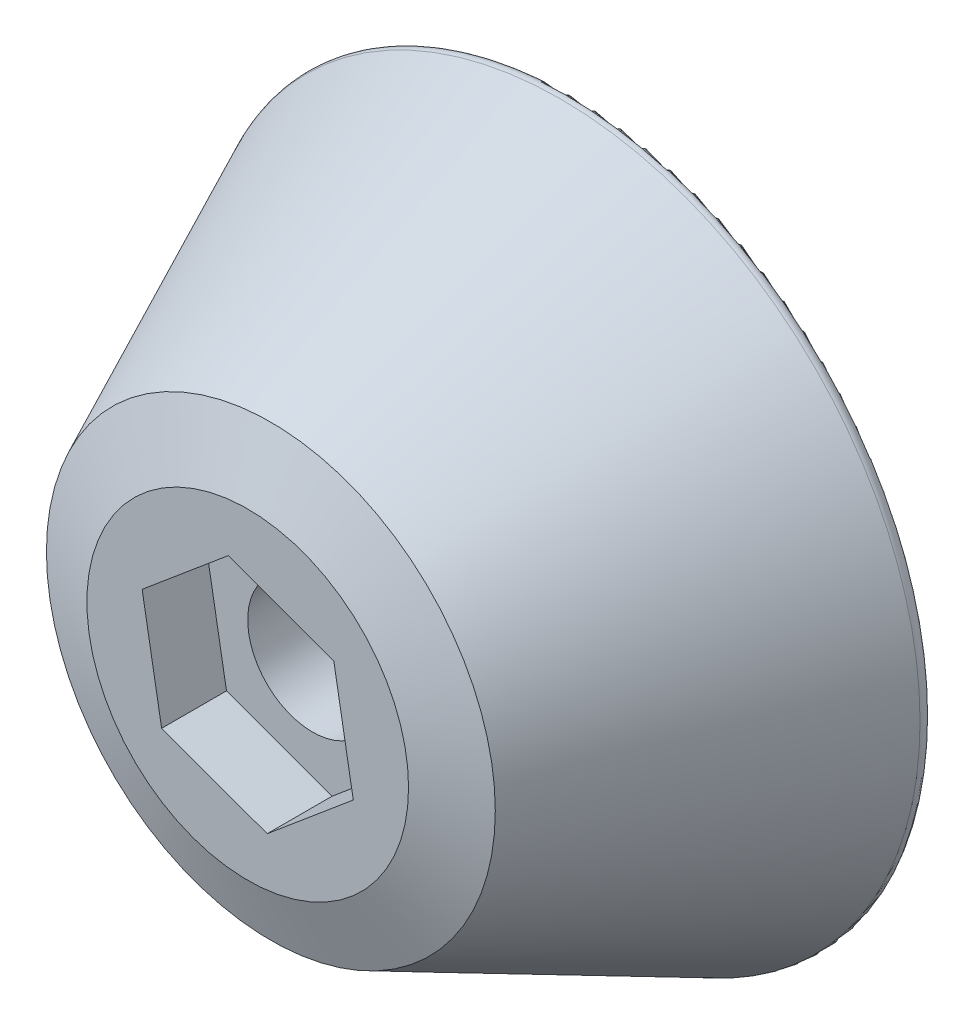
ISO-10303-21;
HEADER;
FILE_DESCRIPTION(('STEP AP214'),'2;1');
FILE_NAME('part.step','',(''),(''),'','','');
FILE_SCHEMA(('AUTOMOTIVE_DESIGN { 1 0 10303 214 1 1 1 1 }'));
ENDSEC;
DATA;
#1=APPLICATION_CONTEXT('core data for automotive mechanical design processes');
#2=APPLICATION_PROTOCOL_DEFINITION('international standard','automotive_design',2000,#1);
#3=PRODUCT_CONTEXT('',#1,'mechanical');
#4=PRODUCT('Part','Part','',(#3));
#5=PRODUCT_RELATED_PRODUCT_CATEGORY('part','',(#4));
#6=PRODUCT_DEFINITION_FORMATION('','',#4);
#7=PRODUCT_DEFINITION_CONTEXT('part definition',#1,'design');
#8=PRODUCT_DEFINITION('design','',#6,#7);
#9=PRODUCT_DEFINITION_SHAPE('','',#8);
#10=(LENGTH_UNIT() NAMED_UNIT(*) SI_UNIT(.MILLI.,.METRE.));
#11=(NAMED_UNIT(*) PLANE_ANGLE_UNIT() SI_UNIT($,.RADIAN.));
#12=(NAMED_UNIT(*) SI_UNIT($,.STERADIAN.) SOLID_ANGLE_UNIT());
#13=UNCERTAINTY_MEASURE_WITH_UNIT(LENGTH_MEASURE(1.E-05),#10,'distance_accuracy_value','');
#14=(GEOMETRIC_REPRESENTATION_CONTEXT(3) GLOBAL_UNCERTAINTY_ASSIGNED_CONTEXT((#13)) GLOBAL_UNIT_ASSIGNED_CONTEXT((#10,
#11,#12)) REPRESENTATION_CONTEXT('',''));
#15=CARTESIAN_POINT('',(0.,0.,0.));
#16=DIRECTION('',(0.,0.,1.));
#17=DIRECTION('',(1.,0.,0.));
#18=AXIS2_PLACEMENT_3D('',#15,#16,#17);
#19=CARTESIAN_POINT('',(0.,0.,0.));
#20=DIRECTION('',(0.,0.,-1.));
#21=DIRECTION('',(1.,0.,0.));
#22=AXIS2_PLACEMENT_3D('',#19,#20,#21);
#23=CONICAL_SURFACE('',#22,28.575,0.436332312998583);
#24=CARTESIAN_POINT('',(0.,0.,0.903362596205347));
#25=DIRECTION('',(0.,0.,1.));
#26=DIRECTION('',(1.,0.,0.));
#27=AXIS2_PLACEMENT_3D('',#24,#25,#26);
#28=CIRCLE('',#27,28.1537551032987);
#29=CARTESIAN_POINT('',(28.1537551032987,0.,0.903362596205347));
#30=VERTEX_POINT('',#29);
#31=EDGE_CURVE('E43',#30,#30,#28,.T.);
#32=ORIENTED_EDGE('',*,*,#31,.T.);
#33=EDGE_LOOP('',(#32));
#34=FACE_BOUND('',#33,.T.);
#35=CARTESIAN_POINT('',(0.,0.,23.5873844259267));
#36=DIRECTION('',(0.,0.,-1.));
#37=DIRECTION('',(-1.,0.,0.));
#38=AXIS2_PLACEMENT_3D('',#35,#36,#37);
#39=CIRCLE('',#38,17.5760220063444);
#40=CARTESIAN_POINT('',(-17.5760220063444,0.,23.5873844259267));
#41=VERTEX_POINT('',#40);
#42=EDGE_CURVE('E146',#41,#41,#39,.T.);
#43=ORIENTED_EDGE('',*,*,#42,.T.);
#44=EDGE_LOOP('',(#43));
#45=FACE_BOUND('',#44,.T.);
#46=ADVANCED_FACE('F35',(#34,#45),#23,.T.);
#47=CARTESIAN_POINT('',(0.,0.,25.4));
#48=DIRECTION('',(0.,0.,1.));
#49=DIRECTION('',(1.,0.,0.));
#50=AXIS2_PLACEMENT_3D('',#47,#48,#49);
#51=PLANE('',#50);
#52=DIRECTION('',(-0.173424497134288,0.984847167734019,0.));
#53=VECTOR('',#52,1.);
#54=CARTESIAN_POINT('',(8.26750072052995,-3.01125087563902,25.4));
#55=LINE('',#54,#53);
#56=CARTESIAN_POINT('',(8.26750072052995,-3.01125087563902,25.4));
#57=VERTEX_POINT('',#56);
#58=CARTESIAN_POINT('',(6.74157011573651,5.65424021196558,25.4));
#59=VERTEX_POINT('',#58);
#60=EDGE_CURVE('E50',#57,#59,#55,.T.);
#61=ORIENTED_EDGE('',*,*,#60,.F.);
#62=DIRECTION('',(0.766190417535671,0.642613604023844,0.));
#63=VECTOR('',#62,1.);
#64=CARTESIAN_POINT('',(1.52593060479344,-8.6654910876046,25.4));
#65=LINE('',#64,#63);
#66=CARTESIAN_POINT('',(1.52593060479344,-8.6654910876046,25.4));
#67=VERTEX_POINT('',#66);
#68=EDGE_CURVE('E134',#67,#57,#65,.T.);
#69=ORIENTED_EDGE('',*,*,#68,.F.);
#70=DIRECTION('',(0.939614914669959,-0.342233563710175,0.));
#71=VECTOR('',#70,1.);
#72=CARTESIAN_POINT('',(-6.7415701157365,-5.65424021196557,25.4));
#73=LINE('',#72,#71);
#74=CARTESIAN_POINT('',(-6.7415701157365,-5.65424021196557,25.4));
#75=VERTEX_POINT('',#74);
#76=EDGE_CURVE('E132',#75,#67,#73,.T.);
#77=ORIENTED_EDGE('',*,*,#76,.F.);
#78=DIRECTION('',(0.173424497134288,-0.984847167734019,0.));
#79=VECTOR('',#78,1.);
#80=CARTESIAN_POINT('',(-8.26750072052995,3.01125087563903,25.4));
#81=LINE('',#80,#79);
#82=CARTESIAN_POINT('',(-8.26750072052995,3.01125087563903,25.4));
#83=VERTEX_POINT('',#82);
#84=EDGE_CURVE('E98',#83,#75,#81,.T.);
#85=ORIENTED_EDGE('',*,*,#84,.F.);
#86=DIRECTION('',(-0.766190417535671,-0.642613604023844,0.));
#87=VECTOR('',#86,1.);
#88=CARTESIAN_POINT('',(-1.52593060479344,8.6654910876046,25.4));
#89=LINE('',#88,#87);
#90=CARTESIAN_POINT('',(-1.52593060479344,8.6654910876046,25.4));
#91=VERTEX_POINT('',#90);
#92=EDGE_CURVE('E128',#91,#83,#89,.T.);
#93=ORIENTED_EDGE('',*,*,#92,.F.);
#94=DIRECTION('',(-0.939614914669959,0.342233563710174,0.));
#95=VECTOR('',#94,1.);
#96=CARTESIAN_POINT('',(6.74157011573651,5.65424021196557,25.4));
#97=LINE('',#96,#95);
#98=EDGE_CURVE('E124',#59,#91,#97,.T.);
#99=ORIENTED_EDGE('',*,*,#98,.F.);
#100=EDGE_LOOP('',(#61,#69,#77,#85,#93,#99));
#101=FACE_BOUND('',#100,.T.);
#102=CARTESIAN_POINT('',(0.,0.,25.4));
#103=DIRECTION('',(0.,0.,1.));
#104=DIRECTION('',(1.,0.,0.));
#105=AXIS2_PLACEMENT_3D('',#102,#103,#104);
#106=CIRCLE('',#105,12.5959016464262);
#107=CARTESIAN_POINT('',(12.5959016464262,0.,25.4));
#108=VERTEX_POINT('',#107);
#109=EDGE_CURVE('E138',#108,#108,#106,.T.);
#110=ORIENTED_EDGE('',*,*,#109,.T.);
#111=EDGE_LOOP('',(#110));
#112=FACE_BOUND('',#111,.T.);
#113=ADVANCED_FACE('F163',(#101,#112),#51,.T.);
#114=CARTESIAN_POINT('',(0.,0.,0.));
#115=DIRECTION('',(0.,0.,1.));
#116=DIRECTION('',(1.,0.,0.));
#117=AXIS2_PLACEMENT_3D('',#114,#115,#116);
#118=PLANE('',#117);
#119=CARTESIAN_POINT('',(0.,0.,0.));
#120=DIRECTION('',(0.,0.,1.));
#121=DIRECTION('',(1.,0.,0.));
#122=AXIS2_PLACEMENT_3D('',#119,#120,#121);
#123=CIRCLE('',#122,27.5782496585304);
#124=CARTESIAN_POINT('',(27.5782496585304,0.,0.));
#125=VERTEX_POINT('',#124);
#126=EDGE_CURVE('E11',#125,#125,#123,.F.);
#127=ORIENTED_EDGE('',*,*,#126,.T.);
#128=EDGE_LOOP('',(#127));
#129=FACE_BOUND('',#128,.T.);
#130=CARTESIAN_POINT('',(0.,0.,0.));
#131=DIRECTION('',(0.,0.,1.));
#132=DIRECTION('',(1.,0.,0.));
#133=AXIS2_PLACEMENT_3D('',#130,#131,#132);
#134=CIRCLE('',#133,5.08);
#135=CARTESIAN_POINT('',(5.08,0.,0.));
#136=VERTEX_POINT('',#135);
#137=EDGE_CURVE('E125',#136,#136,#134,.T.);
#138=ORIENTED_EDGE('',*,*,#137,.T.);
#139=EDGE_LOOP('',(#138));
#140=FACE_BOUND('',#139,.T.);
#141=ADVANCED_FACE('F168',(#129,#140),#118,.F.);
#142=CARTESIAN_POINT('',(0.,0.,25.4));
#143=DIRECTION('',(0.,0.,-1.));
#144=DIRECTION('',(-1.,0.,0.));
#145=AXIS2_PLACEMENT_3D('',#142,#143,#144);
#146=CONICAL_SURFACE('',#145,12.5959016464262,1.22173047639603);
#147=ORIENTED_EDGE('',*,*,#42,.F.);
#148=EDGE_LOOP('',(#147));
#149=FACE_BOUND('',#148,.T.);
#150=ORIENTED_EDGE('',*,*,#109,.F.);
#151=EDGE_LOOP('',(#150));
#152=FACE_BOUND('',#151,.T.);
#153=ADVANCED_FACE('F173',(#149,#152),#146,.T.);
#154=CARTESIAN_POINT('',(8.26750072052995,-3.01125087563902,20.32));
#155=DIRECTION('',(0.984847167734019,0.173424497134288,0.));
#156=DIRECTION('',(-0.173424497134288,0.984847167734019,0.));
#157=AXIS2_PLACEMENT_3D('',#154,#155,#156);
#158=PLANE('',#157);
#159=ORIENTED_EDGE('',*,*,#60,.T.);
#160=DIRECTION('',(0.,0.,1.));
#161=VECTOR('',#160,1.);
#162=CARTESIAN_POINT('',(6.74157011573651,5.65424021196557,20.32));
#163=LINE('',#162,#161);
#164=CARTESIAN_POINT('',(6.74157011573651,5.65424021196557,20.32));
#165=VERTEX_POINT('',#164);
#166=EDGE_CURVE('E80',#165,#59,#163,.T.);
#167=ORIENTED_EDGE('',*,*,#166,.F.);
#168=DIRECTION('',(-0.173424497134288,0.984847167734019,0.));
#169=VECTOR('',#168,1.);
#170=CARTESIAN_POINT('',(8.26750072052995,-3.01125087563902,20.32));
#171=LINE('',#170,#169);
#172=CARTESIAN_POINT('',(8.26750072052995,-3.01125087563902,20.32));
#173=VERTEX_POINT('',#172);
#174=EDGE_CURVE('E136',#173,#165,#171,.T.);
#175=ORIENTED_EDGE('',*,*,#174,.F.);
#176=DIRECTION('',(0.,0.,1.));
#177=VECTOR('',#176,1.);
#178=CARTESIAN_POINT('',(8.26750072052995,-3.01125087563902,20.32));
#179=LINE('',#178,#177);
#180=EDGE_CURVE('E58',#173,#57,#179,.T.);
#181=ORIENTED_EDGE('',*,*,#180,.T.);
#182=EDGE_LOOP('',(#159,#167,#175,#181));
#183=FACE_BOUND('',#182,.T.);
#184=ADVANCED_FACE('F177',(#183),#158,.F.);
#185=CARTESIAN_POINT('',(1.52593060479344,-8.6654910876046,20.32));
#186=DIRECTION('',(0.642613604023844,-0.766190417535671,0.));
#187=DIRECTION('',(0.766190417535671,0.642613604023844,0.));
#188=AXIS2_PLACEMENT_3D('',#185,#186,#187);
#189=PLANE('',#188);
#190=ORIENTED_EDGE('',*,*,#68,.T.);
#191=ORIENTED_EDGE('',*,*,#180,.F.);
#192=DIRECTION('',(0.766190417535671,0.642613604023844,0.));
#193=VECTOR('',#192,1.);
#194=CARTESIAN_POINT('',(1.52593060479344,-8.6654910876046,20.32));
#195=LINE('',#194,#193);
#196=CARTESIAN_POINT('',(1.52593060479344,-8.6654910876046,20.32));
#197=VERTEX_POINT('',#196);
#198=EDGE_CURVE('E110',#197,#173,#195,.T.);
#199=ORIENTED_EDGE('',*,*,#198,.F.);
#200=DIRECTION('',(0.,0.,1.));
#201=VECTOR('',#200,1.);
#202=CARTESIAN_POINT('',(1.52593060479344,-8.6654910876046,20.32));
#203=LINE('',#202,#201);
#204=EDGE_CURVE('E102',#197,#67,#203,.T.);
#205=ORIENTED_EDGE('',*,*,#204,.T.);
#206=EDGE_LOOP('',(#190,#191,#199,#205));
#207=FACE_BOUND('',#206,.T.);
#208=ADVANCED_FACE('F183',(#207),#189,.F.);
#209=CARTESIAN_POINT('',(-6.7415701157365,-5.65424021196557,20.32));
#210=DIRECTION('',(-0.342233563710175,-0.939614914669959,0.));
#211=DIRECTION('',(0.939614914669959,-0.342233563710175,0.));
#212=AXIS2_PLACEMENT_3D('',#209,#210,#211);
#213=PLANE('',#212);
#214=ORIENTED_EDGE('',*,*,#76,.T.);
#215=ORIENTED_EDGE('',*,*,#204,.F.);
#216=DIRECTION('',(0.939614914669959,-0.342233563710175,0.));
#217=VECTOR('',#216,1.);
#218=CARTESIAN_POINT('',(-6.7415701157365,-5.65424021196557,20.32));
#219=LINE('',#218,#217);
#220=CARTESIAN_POINT('',(-6.7415701157365,-5.65424021196557,20.32));
#221=VERTEX_POINT('',#220);
#222=EDGE_CURVE('E106',#221,#197,#219,.T.);
#223=ORIENTED_EDGE('',*,*,#222,.F.);
#224=DIRECTION('',(0.,0.,1.));
#225=VECTOR('',#224,1.);
#226=CARTESIAN_POINT('',(-6.7415701157365,-5.65424021196557,20.32));
#227=LINE('',#226,#225);
#228=EDGE_CURVE('E91',#221,#75,#227,.T.);
#229=ORIENTED_EDGE('',*,*,#228,.T.);
#230=EDGE_LOOP('',(#214,#215,#223,#229));
#231=FACE_BOUND('',#230,.T.);
#232=ADVANCED_FACE('F107',(#231),#213,.F.);
#233=CARTESIAN_POINT('',(-8.26750072052995,3.01125087563903,20.32));
#234=DIRECTION('',(-0.984847167734019,-0.173424497134288,0.));
#235=DIRECTION('',(0.173424497134288,-0.984847167734019,0.));
#236=AXIS2_PLACEMENT_3D('',#233,#234,#235);
#237=PLANE('',#236);
#238=ORIENTED_EDGE('',*,*,#84,.T.);
#239=ORIENTED_EDGE('',*,*,#228,.F.);
#240=DIRECTION('',(0.173424497134288,-0.984847167734019,0.));
#241=VECTOR('',#240,1.);
#242=CARTESIAN_POINT('',(-8.26750072052995,3.01125087563903,20.32));
#243=LINE('',#242,#241);
#244=CARTESIAN_POINT('',(-8.26750072052995,3.01125087563903,20.32));
#245=VERTEX_POINT('',#244);
#246=EDGE_CURVE('E95',#245,#221,#243,.T.);
#247=ORIENTED_EDGE('',*,*,#246,.F.);
#248=DIRECTION('',(0.,0.,1.));
#249=VECTOR('',#248,1.);
#250=CARTESIAN_POINT('',(-8.26750072052995,3.01125087563903,20.32));
#251=LINE('',#250,#249);
#252=EDGE_CURVE('E103',#245,#83,#251,.T.);
#253=ORIENTED_EDGE('',*,*,#252,.T.);
#254=EDGE_LOOP('',(#238,#239,#247,#253));
#255=FACE_BOUND('',#254,.T.);
#256=ADVANCED_FACE('F93',(#255),#237,.F.);
#257=CARTESIAN_POINT('',(-1.52593060479344,8.6654910876046,20.32));
#258=DIRECTION('',(-0.642613604023845,0.766190417535671,0.));
#259=DIRECTION('',(-0.766190417535671,-0.642613604023844,0.));
#260=AXIS2_PLACEMENT_3D('',#257,#258,#259);
#261=PLANE('',#260);
#262=ORIENTED_EDGE('',*,*,#92,.T.);
#263=ORIENTED_EDGE('',*,*,#252,.F.);
#264=DIRECTION('',(-0.766190417535671,-0.642613604023844,0.));
#265=VECTOR('',#264,1.);
#266=CARTESIAN_POINT('',(-1.52593060479344,8.6654910876046,20.32));
#267=LINE('',#266,#265);
#268=CARTESIAN_POINT('',(-1.52593060479344,8.6654910876046,20.32));
#269=VERTEX_POINT('',#268);
#270=EDGE_CURVE('E116',#269,#245,#267,.T.);
#271=ORIENTED_EDGE('',*,*,#270,.F.);
#272=DIRECTION('',(0.,0.,1.));
#273=VECTOR('',#272,1.);
#274=CARTESIAN_POINT('',(-1.52593060479344,8.6654910876046,20.32));
#275=LINE('',#274,#273);
#276=EDGE_CURVE('E141',#269,#91,#275,.T.);
#277=ORIENTED_EDGE('',*,*,#276,.T.);
#278=EDGE_LOOP('',(#262,#263,#271,#277));
#279=FACE_BOUND('',#278,.T.);
#280=ADVANCED_FACE('F205',(#279),#261,.F.);
#281=CARTESIAN_POINT('',(6.74157011573651,5.65424021196557,20.32));
#282=DIRECTION('',(0.342233563710174,0.939614914669959,0.));
#283=DIRECTION('',(-0.939614914669959,0.342233563710174,0.));
#284=AXIS2_PLACEMENT_3D('',#281,#282,#283);
#285=PLANE('',#284);
#286=ORIENTED_EDGE('',*,*,#98,.T.);
#287=ORIENTED_EDGE('',*,*,#276,.F.);
#288=DIRECTION('',(-0.939614914669959,0.342233563710174,0.));
#289=VECTOR('',#288,1.);
#290=CARTESIAN_POINT('',(6.74157011573651,5.65424021196557,20.32));
#291=LINE('',#290,#289);
#292=EDGE_CURVE('E118',#165,#269,#291,.T.);
#293=ORIENTED_EDGE('',*,*,#292,.F.);
#294=ORIENTED_EDGE('',*,*,#166,.T.);
#295=EDGE_LOOP('',(#286,#287,#293,#294));
#296=FACE_BOUND('',#295,.T.);
#297=ADVANCED_FACE('F201',(#296),#285,.F.);
#298=CARTESIAN_POINT('',(0.,0.,20.32));
#299=DIRECTION('',(0.,0.,1.));
#300=DIRECTION('',(1.,0.,0.));
#301=AXIS2_PLACEMENT_3D('',#298,#299,#300);
#302=PLANE('',#301);
#303=CARTESIAN_POINT('',(0.,0.,20.32));
#304=DIRECTION('',(0.,0.,1.));
#305=DIRECTION('',(1.,0.,0.));
#306=AXIS2_PLACEMENT_3D('',#303,#304,#305);
#307=CIRCLE('',#306,5.08);
#308=CARTESIAN_POINT('',(5.08,0.,20.32));
#309=VERTEX_POINT('',#308);
#310=EDGE_CURVE('E195',#309,#309,#307,.T.);
#311=ORIENTED_EDGE('',*,*,#310,.F.);
#312=EDGE_LOOP('',(#311));
#313=FACE_BOUND('',#312,.T.);
#314=ORIENTED_EDGE('',*,*,#174,.T.);
#315=ORIENTED_EDGE('',*,*,#292,.T.);
#316=ORIENTED_EDGE('',*,*,#270,.T.);
#317=ORIENTED_EDGE('',*,*,#246,.T.);
#318=ORIENTED_EDGE('',*,*,#222,.T.);
#319=ORIENTED_EDGE('',*,*,#198,.T.);
#320=EDGE_LOOP('',(#314,#315,#316,#317,#318,#319));
#321=FACE_BOUND('',#320,.T.);
#322=ADVANCED_FACE('F113',(#313,#321),#302,.T.);
#323=CARTESIAN_POINT('',(0.,0.,0.));
#324=DIRECTION('',(0.,0.,1.));
#325=DIRECTION('',(1.,0.,0.));
#326=AXIS2_PLACEMENT_3D('',#323,#324,#325);
#327=CYLINDRICAL_SURFACE('',#326,5.08);
#328=ORIENTED_EDGE('',*,*,#137,.F.);
#329=EDGE_LOOP('',(#328));
#330=FACE_BOUND('',#329,.T.);
#331=ORIENTED_EDGE('',*,*,#310,.T.);
#332=EDGE_LOOP('',(#331));
#333=FACE_BOUND('',#332,.T.);
#334=ADVANCED_FACE('F154',(#330,#333),#327,.F.);
#335=CARTESIAN_POINT('',(0.,0.,0.635));
#336=DIRECTION('',(0.,0.,1.));
#337=DIRECTION('',(1.,0.,0.));
#338=AXIS2_PLACEMENT_3D('',#335,#336,#337);
#339=TOROIDAL_SURFACE('',#338,27.5782496585304,0.635);
#340=ORIENTED_EDGE('',*,*,#126,.F.);
#341=EDGE_LOOP('',(#340));
#342=FACE_BOUND('',#341,.T.);
#343=ORIENTED_EDGE('',*,*,#31,.F.);
#344=EDGE_LOOP('',(#343));
#345=FACE_BOUND('',#344,.T.);
#346=ADVANCED_FACE('F37',(#342,#345),#339,.T.);
#347=CLOSED_SHELL('',(#46,#113,#141,#153,#184,#208,#232,#256,#280,#297,#322,#334,#346));
#348=MANIFOLD_SOLID_BREP('B2',#347);
#349=ADVANCED_BREP_SHAPE_REPRESENTATION('',(#18,#348),#14);
#350=SHAPE_DEFINITION_REPRESENTATION(#9,#349);
ENDSEC;
END-ISO-10303-21;
